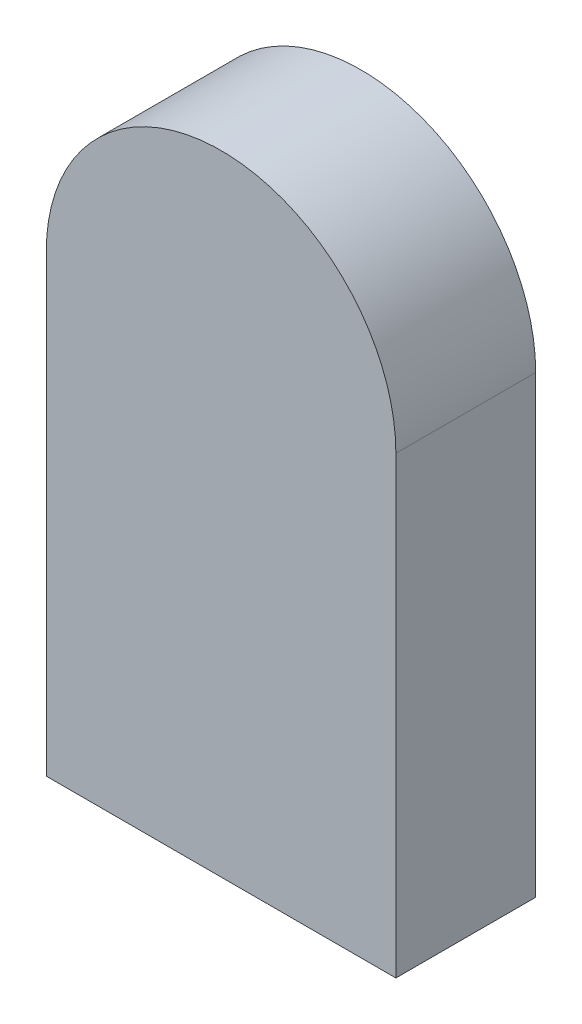
ISO-10303-21;
HEADER;
FILE_DESCRIPTION(('STEP AP214'),'2;1');
FILE_NAME('part.step','',(''),(''),'','','');
FILE_SCHEMA(('AUTOMOTIVE_DESIGN { 1 0 10303 214 1 1 1 1 }'));
ENDSEC;
DATA;
#1=APPLICATION_CONTEXT('core data for automotive mechanical design processes');
#2=APPLICATION_PROTOCOL_DEFINITION('international standard','automotive_design',2000,#1);
#3=PRODUCT_CONTEXT('',#1,'mechanical');
#4=PRODUCT('Part','Part','',(#3));
#5=PRODUCT_RELATED_PRODUCT_CATEGORY('part','',(#4));
#6=PRODUCT_DEFINITION_FORMATION('','',#4);
#7=PRODUCT_DEFINITION_CONTEXT('part definition',#1,'design');
#8=PRODUCT_DEFINITION('design','',#6,#7);
#9=PRODUCT_DEFINITION_SHAPE('','',#8);
#10=(LENGTH_UNIT() NAMED_UNIT(*) SI_UNIT(.MILLI.,.METRE.));
#11=(NAMED_UNIT(*) PLANE_ANGLE_UNIT() SI_UNIT($,.RADIAN.));
#12=(NAMED_UNIT(*) SI_UNIT($,.STERADIAN.) SOLID_ANGLE_UNIT());
#13=UNCERTAINTY_MEASURE_WITH_UNIT(LENGTH_MEASURE(1.E-05),#10,'distance_accuracy_value','');
#14=(GEOMETRIC_REPRESENTATION_CONTEXT(3) GLOBAL_UNCERTAINTY_ASSIGNED_CONTEXT((#13)) GLOBAL_UNIT_ASSIGNED_CONTEXT((#10,
#11,#12)) REPRESENTATION_CONTEXT('',''));
#15=CARTESIAN_POINT('',(0.,0.,0.));
#16=DIRECTION('',(0.,0.,1.));
#17=DIRECTION('',(1.,0.,0.));
#18=AXIS2_PLACEMENT_3D('',#15,#16,#17);
#19=CARTESIAN_POINT('',(-0.875,-2.05,0.));
#20=DIRECTION('',(0.,1.,0.));
#21=DIRECTION('',(1.,0.,0.));
#22=AXIS2_PLACEMENT_3D('',#19,#20,#21);
#23=PLANE('',#22);
#24=DIRECTION('',(1.,0.,0.));
#25=VECTOR('',#24,1.);
#26=CARTESIAN_POINT('',(-0.875,-2.05,0.));
#27=LINE('',#26,#25);
#28=CARTESIAN_POINT('',(-0.875,-2.05,0.));
#29=VERTEX_POINT('',#28);
#30=CARTESIAN_POINT('',(-0.625,-2.05,0.));
#31=VERTEX_POINT('',#30);
#32=EDGE_CURVE('E11',#29,#31,#27,.T.);
#33=ORIENTED_EDGE('',*,*,#32,.T.);
#34=DIRECTION('',(0.,0.,1.));
#35=VECTOR('',#34,1.);
#36=CARTESIAN_POINT('',(-0.625,-2.05,0.));
#37=LINE('',#36,#35);
#38=CARTESIAN_POINT('',(-0.625,-2.05,0.1));
#39=VERTEX_POINT('',#38);
#40=EDGE_CURVE('E24',#31,#39,#37,.T.);
#41=ORIENTED_EDGE('',*,*,#40,.T.);
#42=DIRECTION('',(1.,0.,0.));
#43=VECTOR('',#42,1.);
#44=CARTESIAN_POINT('',(-0.875,-2.05,0.1));
#45=LINE('',#44,#43);
#46=CARTESIAN_POINT('',(-0.875,-2.05,0.1));
#47=VERTEX_POINT('',#46);
#48=EDGE_CURVE('E87',#47,#39,#45,.T.);
#49=ORIENTED_EDGE('',*,*,#48,.F.);
#50=DIRECTION('',(0.,0.,1.));
#51=VECTOR('',#50,1.);
#52=CARTESIAN_POINT('',(-0.875,-2.05,0.));
#53=LINE('',#52,#51);
#54=EDGE_CURVE('E36',#29,#47,#53,.T.);
#55=ORIENTED_EDGE('',*,*,#54,.F.);
#56=EDGE_LOOP('',(#33,#41,#49,#55));
#57=FACE_BOUND('',#56,.T.);
#58=ADVANCED_FACE('F17',(#57),#23,.F.);
#59=CARTESIAN_POINT('',(-0.625,-2.05,0.));
#60=DIRECTION('',(-1.,0.,0.));
#61=DIRECTION('',(0.,1.,0.));
#62=AXIS2_PLACEMENT_3D('',#59,#60,#61);
#63=PLANE('',#62);
#64=DIRECTION('',(0.,1.,0.));
#65=VECTOR('',#64,1.);
#66=CARTESIAN_POINT('',(-0.625,-2.05,0.));
#67=LINE('',#66,#65);
#68=CARTESIAN_POINT('',(-0.625,-1.725,0.));
#69=VERTEX_POINT('',#68);
#70=EDGE_CURVE('E84',#31,#69,#67,.T.);
#71=ORIENTED_EDGE('',*,*,#70,.T.);
#72=DIRECTION('',(0.,0.,1.));
#73=VECTOR('',#72,1.);
#74=CARTESIAN_POINT('',(-0.625,-1.725,0.));
#75=LINE('',#74,#73);
#76=CARTESIAN_POINT('',(-0.625,-1.725,0.1));
#77=VERTEX_POINT('',#76);
#78=EDGE_CURVE('E82',#69,#77,#75,.T.);
#79=ORIENTED_EDGE('',*,*,#78,.T.);
#80=DIRECTION('',(0.,1.,0.));
#81=VECTOR('',#80,1.);
#82=CARTESIAN_POINT('',(-0.625,-2.05,0.1));
#83=LINE('',#82,#81);
#84=EDGE_CURVE('E72',#39,#77,#83,.T.);
#85=ORIENTED_EDGE('',*,*,#84,.F.);
#86=ORIENTED_EDGE('',*,*,#40,.F.);
#87=EDGE_LOOP('',(#71,#79,#85,#86));
#88=FACE_BOUND('',#87,.T.);
#89=ADVANCED_FACE('F89',(#88),#63,.F.);
#90=CARTESIAN_POINT('',(-0.75,-1.725,0.));
#91=DIRECTION('',(0.,0.,-1.));
#92=DIRECTION('',(1.,0.,0.));
#93=AXIS2_PLACEMENT_3D('',#90,#91,#92);
#94=CYLINDRICAL_SURFACE('',#93,0.125);
#95=CARTESIAN_POINT('',(-0.75,-1.725,0.));
#96=DIRECTION('',(0.,0.,1.));
#97=DIRECTION('',(1.,0.,0.));
#98=AXIS2_PLACEMENT_3D('',#95,#96,#97);
#99=CIRCLE('',#98,0.125);
#100=CARTESIAN_POINT('',(-0.875,-1.725,0.));
#101=VERTEX_POINT('',#100);
#102=EDGE_CURVE('E62',#69,#101,#99,.T.);
#103=ORIENTED_EDGE('',*,*,#102,.T.);
#104=DIRECTION('',(0.,0.,1.));
#105=VECTOR('',#104,1.);
#106=CARTESIAN_POINT('',(-0.875,-1.725,0.));
#107=LINE('',#106,#105);
#108=CARTESIAN_POINT('',(-0.875,-1.725,0.1));
#109=VERTEX_POINT('',#108);
#110=EDGE_CURVE('E57',#101,#109,#107,.T.);
#111=ORIENTED_EDGE('',*,*,#110,.T.);
#112=CARTESIAN_POINT('',(-0.75,-1.725,0.1));
#113=DIRECTION('',(0.,0.,1.));
#114=DIRECTION('',(1.,0.,0.));
#115=AXIS2_PLACEMENT_3D('',#112,#113,#114);
#116=CIRCLE('',#115,0.125);
#117=EDGE_CURVE('E60',#77,#109,#116,.T.);
#118=ORIENTED_EDGE('',*,*,#117,.F.);
#119=ORIENTED_EDGE('',*,*,#78,.F.);
#120=EDGE_LOOP('',(#103,#111,#118,#119));
#121=FACE_BOUND('',#120,.T.);
#122=ADVANCED_FACE('F59',(#121),#94,.T.);
#123=CARTESIAN_POINT('',(-0.875,-2.05,0.));
#124=DIRECTION('',(-1.,0.,0.));
#125=DIRECTION('',(0.,1.,0.));
#126=AXIS2_PLACEMENT_3D('',#123,#124,#125);
#127=PLANE('',#126);
#128=ORIENTED_EDGE('',*,*,#54,.T.);
#129=DIRECTION('',(0.,1.,0.));
#130=VECTOR('',#129,1.);
#131=CARTESIAN_POINT('',(-0.875,-2.05,0.1));
#132=LINE('',#131,#130);
#133=EDGE_CURVE('E71',#47,#109,#132,.T.);
#134=ORIENTED_EDGE('',*,*,#133,.T.);
#135=ORIENTED_EDGE('',*,*,#110,.F.);
#136=DIRECTION('',(0.,1.,0.));
#137=VECTOR('',#136,1.);
#138=CARTESIAN_POINT('',(-0.875,-2.05,0.));
#139=LINE('',#138,#137);
#140=EDGE_CURVE('E76',#29,#101,#139,.T.);
#141=ORIENTED_EDGE('',*,*,#140,.F.);
#142=EDGE_LOOP('',(#128,#134,#135,#141));
#143=FACE_BOUND('',#142,.T.);
#144=ADVANCED_FACE('F75',(#143),#127,.T.);
#145=CARTESIAN_POINT('',(-0.75,-1.850342514613,0.));
#146=DIRECTION('',(0.,0.,1.));
#147=DIRECTION('',(1.,0.,0.));
#148=AXIS2_PLACEMENT_3D('',#145,#146,#147);
#149=PLANE('',#148);
#150=ORIENTED_EDGE('',*,*,#140,.T.);
#151=ORIENTED_EDGE('',*,*,#102,.F.);
#152=ORIENTED_EDGE('',*,*,#70,.F.);
#153=ORIENTED_EDGE('',*,*,#32,.F.);
#154=EDGE_LOOP('',(#150,#151,#152,#153));
#155=FACE_BOUND('',#154,.T.);
#156=ADVANCED_FACE('F91',(#155),#149,.F.);
#157=CARTESIAN_POINT('',(-0.75,-1.850342514613,0.1));
#158=DIRECTION('',(0.,0.,1.));
#159=DIRECTION('',(1.,0.,0.));
#160=AXIS2_PLACEMENT_3D('',#157,#158,#159);
#161=PLANE('',#160);
#162=ORIENTED_EDGE('',*,*,#48,.T.);
#163=ORIENTED_EDGE('',*,*,#84,.T.);
#164=ORIENTED_EDGE('',*,*,#117,.T.);
#165=ORIENTED_EDGE('',*,*,#133,.F.);
#166=EDGE_LOOP('',(#162,#163,#164,#165));
#167=FACE_BOUND('',#166,.T.);
#168=ADVANCED_FACE('F70',(#167),#161,.T.);
#169=CLOSED_SHELL('',(#58,#89,#122,#144,#156,#168));
#170=MANIFOLD_SOLID_BREP('B1',#169);
#171=ADVANCED_BREP_SHAPE_REPRESENTATION('',(#18,#170),#14);
#172=SHAPE_DEFINITION_REPRESENTATION(#9,#171);
ENDSEC;
END-ISO-10303-21;
